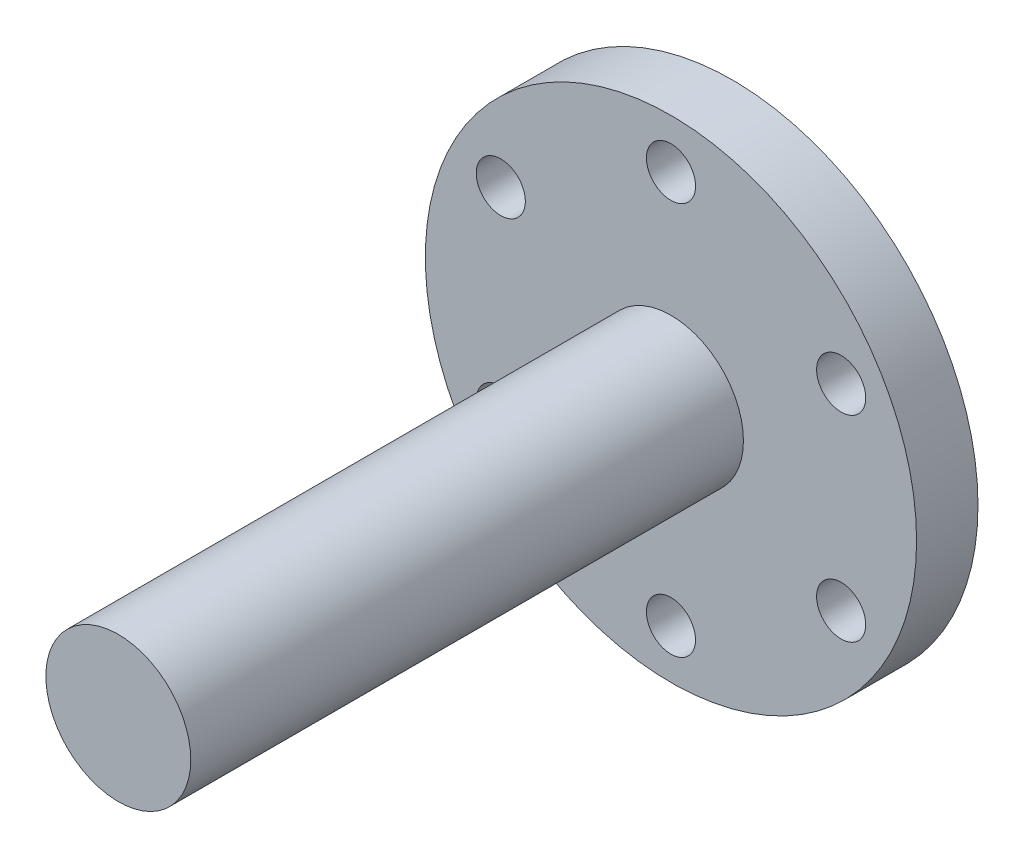
ISO-10303-21;
HEADER;
FILE_DESCRIPTION(('STEP AP214'),'2;1');
FILE_NAME('part.step','',(''),(''),'','','');
FILE_SCHEMA(('AUTOMOTIVE_DESIGN { 1 0 10303 214 1 1 1 1 }'));
ENDSEC;
DATA;
#1=APPLICATION_CONTEXT('core data for automotive mechanical design processes');
#2=APPLICATION_PROTOCOL_DEFINITION('international standard','automotive_design',2000,#1);
#3=PRODUCT_CONTEXT('',#1,'mechanical');
#4=PRODUCT('Part','Part','',(#3));
#5=PRODUCT_RELATED_PRODUCT_CATEGORY('part','',(#4));
#6=PRODUCT_DEFINITION_FORMATION('','',#4);
#7=PRODUCT_DEFINITION_CONTEXT('part definition',#1,'design');
#8=PRODUCT_DEFINITION('design','',#6,#7);
#9=PRODUCT_DEFINITION_SHAPE('','',#8);
#10=(LENGTH_UNIT() NAMED_UNIT(*) SI_UNIT(.MILLI.,.METRE.));
#11=(NAMED_UNIT(*) PLANE_ANGLE_UNIT() SI_UNIT($,.RADIAN.));
#12=(NAMED_UNIT(*) SI_UNIT($,.STERADIAN.) SOLID_ANGLE_UNIT());
#13=UNCERTAINTY_MEASURE_WITH_UNIT(LENGTH_MEASURE(1.E-05),#10,'distance_accuracy_value','');
#14=(GEOMETRIC_REPRESENTATION_CONTEXT(3) GLOBAL_UNCERTAINTY_ASSIGNED_CONTEXT((#13)) GLOBAL_UNIT_ASSIGNED_CONTEXT((#10,
#11,#12)) REPRESENTATION_CONTEXT('',''));
#15=CARTESIAN_POINT('',(0.,0.,0.));
#16=DIRECTION('',(0.,0.,1.));
#17=DIRECTION('',(1.,0.,0.));
#18=AXIS2_PLACEMENT_3D('',#15,#16,#17);
#19=CARTESIAN_POINT('',(0.,0.,5.));
#20=DIRECTION('',(0.,0.,-1.));
#21=DIRECTION('',(-1.,0.,0.));
#22=AXIS2_PLACEMENT_3D('',#19,#20,#21);
#23=CYLINDRICAL_SURFACE('',#22,20.);
#24=CARTESIAN_POINT('',(0.,0.,5.));
#25=DIRECTION('',(0.,0.,1.));
#26=DIRECTION('',(1.,0.,0.));
#27=AXIS2_PLACEMENT_3D('',#24,#25,#26);
#28=CIRCLE('',#27,20.);
#29=CARTESIAN_POINT('',(20.,0.,5.));
#30=VERTEX_POINT('',#29);
#31=EDGE_CURVE('E47',#30,#30,#28,.T.);
#32=ORIENTED_EDGE('',*,*,#31,.F.);
#33=EDGE_LOOP('',(#32));
#34=FACE_BOUND('',#33,.T.);
#35=CARTESIAN_POINT('',(0.,0.,0.));
#36=DIRECTION('',(0.,0.,1.));
#37=DIRECTION('',(1.,0.,0.));
#38=AXIS2_PLACEMENT_3D('',#35,#36,#37);
#39=CIRCLE('',#38,20.);
#40=CARTESIAN_POINT('',(20.,0.,0.));
#41=VERTEX_POINT('',#40);
#42=EDGE_CURVE('E42',#41,#41,#39,.T.);
#43=ORIENTED_EDGE('',*,*,#42,.T.);
#44=EDGE_LOOP('',(#43));
#45=FACE_BOUND('',#44,.T.);
#46=ADVANCED_FACE('F39',(#34,#45),#23,.T.);
#47=CARTESIAN_POINT('',(0.,0.,5.));
#48=DIRECTION('',(0.,0.,1.));
#49=DIRECTION('',(1.,0.,0.));
#50=AXIS2_PLACEMENT_3D('',#47,#48,#49);
#51=PLANE('',#50);
#52=CARTESIAN_POINT('',(0.,16.,5.));
#53=DIRECTION('',(0.,0.,1.));
#54=DIRECTION('',(1.,0.,0.));
#55=AXIS2_PLACEMENT_3D('',#52,#53,#54);
#56=CIRCLE('',#55,2.);
#57=CARTESIAN_POINT('',(2.,16.,5.));
#58=VERTEX_POINT('',#57);
#59=EDGE_CURVE('E92',#58,#58,#56,.T.);
#60=ORIENTED_EDGE('',*,*,#59,.F.);
#61=EDGE_LOOP('',(#60));
#62=FACE_BOUND('',#61,.T.);
#63=CARTESIAN_POINT('',(-13.8564064605506,7.99999999999921,5.));
#64=DIRECTION('',(0.,0.,1.));
#65=DIRECTION('',(1.,0.,0.));
#66=AXIS2_PLACEMENT_3D('',#63,#64,#65);
#67=CIRCLE('',#66,2.00000000000085);
#68=CARTESIAN_POINT('',(-11.8564064605497,7.99999999999921,5.));
#69=VERTEX_POINT('',#68);
#70=EDGE_CURVE('E93',#69,#69,#67,.T.);
#71=ORIENTED_EDGE('',*,*,#70,.F.);
#72=EDGE_LOOP('',(#71));
#73=FACE_BOUND('',#72,.T.);
#74=CARTESIAN_POINT('',(-13.8564064605497,-8.00000000000079,5.));
#75=DIRECTION('',(0.,0.,1.));
#76=DIRECTION('',(1.,0.,0.));
#77=AXIS2_PLACEMENT_3D('',#74,#75,#76);
#78=CIRCLE('',#77,2.00000000000168);
#79=CARTESIAN_POINT('',(-11.856406460548,-8.00000000000079,5.));
#80=VERTEX_POINT('',#79);
#81=EDGE_CURVE('E59',#80,#80,#78,.T.);
#82=ORIENTED_EDGE('',*,*,#81,.F.);
#83=EDGE_LOOP('',(#82));
#84=FACE_BOUND('',#83,.T.);
#85=CARTESIAN_POINT('',(1.81311109890995E-12,-16.,5.));
#86=DIRECTION('',(0.,0.,1.));
#87=DIRECTION('',(1.,0.,0.));
#88=AXIS2_PLACEMENT_3D('',#85,#86,#87);
#89=CIRCLE('',#88,2.00000000000184);
#90=CARTESIAN_POINT('',(2.00000000000365,-16.,5.));
#91=VERTEX_POINT('',#90);
#92=EDGE_CURVE('E68',#91,#91,#89,.T.);
#93=ORIENTED_EDGE('',*,*,#92,.F.);
#94=EDGE_LOOP('',(#93));
#95=FACE_BOUND('',#94,.T.);
#96=CARTESIAN_POINT('',(13.8564064605524,-7.99999999999921,5.));
#97=DIRECTION('',(0.,0.,1.));
#98=DIRECTION('',(1.,0.,0.));
#99=AXIS2_PLACEMENT_3D('',#96,#97,#98);
#100=CIRCLE('',#99,2.00000000000115);
#101=CARTESIAN_POINT('',(15.8564064605535,-7.99999999999921,5.));
#102=VERTEX_POINT('',#101);
#103=EDGE_CURVE('E76',#102,#102,#100,.T.);
#104=ORIENTED_EDGE('',*,*,#103,.F.);
#105=EDGE_LOOP('',(#104));
#106=FACE_BOUND('',#105,.T.);
#107=CARTESIAN_POINT('',(13.8564064605515,8.00000000000079,5.));
#108=DIRECTION('',(0.,0.,1.));
#109=DIRECTION('',(1.,0.,0.));
#110=AXIS2_PLACEMENT_3D('',#107,#108,#109);
#111=CIRCLE('',#110,2.00000000000025);
#112=CARTESIAN_POINT('',(15.8564064605517,8.00000000000079,5.));
#113=VERTEX_POINT('',#112);
#114=EDGE_CURVE('E84',#113,#113,#111,.T.);
#115=ORIENTED_EDGE('',*,*,#114,.F.);
#116=EDGE_LOOP('',(#115));
#117=FACE_BOUND('',#116,.T.);
#118=CARTESIAN_POINT('',(0.,0.,5.));
#119=DIRECTION('',(0.,0.,1.));
#120=DIRECTION('',(1.,0.,0.));
#121=AXIS2_PLACEMENT_3D('',#118,#119,#120);
#122=CIRCLE('',#121,5.9);
#123=CARTESIAN_POINT('',(5.9,0.,5.));
#124=VERTEX_POINT('',#123);
#125=EDGE_CURVE('E10',#124,#124,#122,.T.);
#126=ORIENTED_EDGE('',*,*,#125,.F.);
#127=EDGE_LOOP('',(#126));
#128=FACE_BOUND('',#127,.T.);
#129=ORIENTED_EDGE('',*,*,#31,.T.);
#130=EDGE_LOOP('',(#129));
#131=FACE_BOUND('',#130,.T.);
#132=ADVANCED_FACE('F117',(#62,#73,#84,#95,#106,#117,#128,#131),#51,.T.);
#133=CARTESIAN_POINT('',(0.,0.,0.));
#134=DIRECTION('',(0.,0.,1.));
#135=DIRECTION('',(1.,0.,0.));
#136=AXIS2_PLACEMENT_3D('',#133,#134,#135);
#137=PLANE('',#136);
#138=CARTESIAN_POINT('',(0.,16.,0.));
#139=DIRECTION('',(0.,0.,1.));
#140=DIRECTION('',(1.,0.,0.));
#141=AXIS2_PLACEMENT_3D('',#138,#139,#140);
#142=CIRCLE('',#141,2.);
#143=CARTESIAN_POINT('',(2.,16.,0.));
#144=VERTEX_POINT('',#143);
#145=EDGE_CURVE('E58',#144,#144,#142,.T.);
#146=ORIENTED_EDGE('',*,*,#145,.T.);
#147=EDGE_LOOP('',(#146));
#148=FACE_BOUND('',#147,.T.);
#149=CARTESIAN_POINT('',(-13.8564064605506,7.99999999999921,0.));
#150=DIRECTION('',(0.,0.,1.));
#151=DIRECTION('',(1.,0.,0.));
#152=AXIS2_PLACEMENT_3D('',#149,#150,#151);
#153=CIRCLE('',#152,2.00000000000085);
#154=CARTESIAN_POINT('',(-11.8564064605497,7.99999999999921,0.));
#155=VERTEX_POINT('',#154);
#156=EDGE_CURVE('E64',#155,#155,#153,.T.);
#157=ORIENTED_EDGE('',*,*,#156,.T.);
#158=EDGE_LOOP('',(#157));
#159=FACE_BOUND('',#158,.T.);
#160=CARTESIAN_POINT('',(-13.8564064605497,-8.00000000000079,0.));
#161=DIRECTION('',(0.,0.,1.));
#162=DIRECTION('',(1.,0.,0.));
#163=AXIS2_PLACEMENT_3D('',#160,#161,#162);
#164=CIRCLE('',#163,2.00000000000168);
#165=CARTESIAN_POINT('',(-11.856406460548,-8.00000000000079,0.));
#166=VERTEX_POINT('',#165);
#167=EDGE_CURVE('E63',#166,#166,#164,.T.);
#168=ORIENTED_EDGE('',*,*,#167,.T.);
#169=EDGE_LOOP('',(#168));
#170=FACE_BOUND('',#169,.T.);
#171=CARTESIAN_POINT('',(1.81311109890995E-12,-16.,0.));
#172=DIRECTION('',(0.,0.,1.));
#173=DIRECTION('',(1.,0.,0.));
#174=AXIS2_PLACEMENT_3D('',#171,#172,#173);
#175=CIRCLE('',#174,2.00000000000184);
#176=CARTESIAN_POINT('',(2.00000000000365,-16.,0.));
#177=VERTEX_POINT('',#176);
#178=EDGE_CURVE('E72',#177,#177,#175,.T.);
#179=ORIENTED_EDGE('',*,*,#178,.T.);
#180=EDGE_LOOP('',(#179));
#181=FACE_BOUND('',#180,.T.);
#182=CARTESIAN_POINT('',(13.8564064605524,-7.99999999999921,0.));
#183=DIRECTION('',(0.,0.,1.));
#184=DIRECTION('',(1.,0.,0.));
#185=AXIS2_PLACEMENT_3D('',#182,#183,#184);
#186=CIRCLE('',#185,2.00000000000115);
#187=CARTESIAN_POINT('',(15.8564064605535,-7.99999999999921,0.));
#188=VERTEX_POINT('',#187);
#189=EDGE_CURVE('E80',#188,#188,#186,.T.);
#190=ORIENTED_EDGE('',*,*,#189,.T.);
#191=EDGE_LOOP('',(#190));
#192=FACE_BOUND('',#191,.T.);
#193=CARTESIAN_POINT('',(13.8564064605515,8.00000000000079,0.));
#194=DIRECTION('',(0.,0.,1.));
#195=DIRECTION('',(1.,0.,0.));
#196=AXIS2_PLACEMENT_3D('',#193,#194,#195);
#197=CIRCLE('',#196,2.00000000000025);
#198=CARTESIAN_POINT('',(15.8564064605517,8.00000000000079,0.));
#199=VERTEX_POINT('',#198);
#200=EDGE_CURVE('E88',#199,#199,#197,.T.);
#201=ORIENTED_EDGE('',*,*,#200,.T.);
#202=EDGE_LOOP('',(#201));
#203=FACE_BOUND('',#202,.T.);
#204=ORIENTED_EDGE('',*,*,#42,.F.);
#205=EDGE_LOOP('',(#204));
#206=FACE_BOUND('',#205,.T.);
#207=ADVANCED_FACE('F107',(#148,#159,#170,#181,#192,#203,#206),#137,.F.);
#208=CARTESIAN_POINT('',(0.,0.,50.));
#209=DIRECTION('',(0.,0.,-1.));
#210=DIRECTION('',(-1.,0.,0.));
#211=AXIS2_PLACEMENT_3D('',#208,#209,#210);
#212=CYLINDRICAL_SURFACE('',#211,5.9);
#213=CARTESIAN_POINT('',(0.,0.,50.));
#214=DIRECTION('',(0.,0.,1.));
#215=DIRECTION('',(1.,0.,0.));
#216=AXIS2_PLACEMENT_3D('',#213,#214,#215);
#217=CIRCLE('',#216,5.9);
#218=CARTESIAN_POINT('',(5.9,0.,50.));
#219=VERTEX_POINT('',#218);
#220=EDGE_CURVE('E54',#219,#219,#217,.T.);
#221=ORIENTED_EDGE('',*,*,#220,.F.);
#222=EDGE_LOOP('',(#221));
#223=FACE_BOUND('',#222,.T.);
#224=ORIENTED_EDGE('',*,*,#125,.T.);
#225=EDGE_LOOP('',(#224));
#226=FACE_BOUND('',#225,.T.);
#227=ADVANCED_FACE('F141',(#223,#226),#212,.T.);
#228=CARTESIAN_POINT('',(0.,0.,50.));
#229=DIRECTION('',(0.,0.,1.));
#230=DIRECTION('',(1.,0.,0.));
#231=AXIS2_PLACEMENT_3D('',#228,#229,#230);
#232=PLANE('',#231);
#233=ORIENTED_EDGE('',*,*,#220,.T.);
#234=EDGE_LOOP('',(#233));
#235=FACE_BOUND('',#234,.T.);
#236=ADVANCED_FACE('F145',(#235),#232,.T.);
#237=CARTESIAN_POINT('',(13.8564064605515,8.00000000000079,0.));
#238=DIRECTION('',(0.,0.,1.));
#239=DIRECTION('',(1.,0.,0.));
#240=AXIS2_PLACEMENT_3D('',#237,#238,#239);
#241=CYLINDRICAL_SURFACE('',#240,2.00000000000025);
#242=ORIENTED_EDGE('',*,*,#200,.F.);
#243=EDGE_LOOP('',(#242));
#244=FACE_BOUND('',#243,.T.);
#245=ORIENTED_EDGE('',*,*,#114,.T.);
#246=EDGE_LOOP('',(#245));
#247=FACE_BOUND('',#246,.T.);
#248=ADVANCED_FACE('F151',(#244,#247),#241,.F.);
#249=CARTESIAN_POINT('',(13.8564064605524,-7.99999999999921,0.));
#250=DIRECTION('',(0.,0.,1.));
#251=DIRECTION('',(1.,0.,0.));
#252=AXIS2_PLACEMENT_3D('',#249,#250,#251);
#253=CYLINDRICAL_SURFACE('',#252,2.00000000000115);
#254=ORIENTED_EDGE('',*,*,#189,.F.);
#255=EDGE_LOOP('',(#254));
#256=FACE_BOUND('',#255,.T.);
#257=ORIENTED_EDGE('',*,*,#103,.T.);
#258=EDGE_LOOP('',(#257));
#259=FACE_BOUND('',#258,.T.);
#260=ADVANCED_FACE('F160',(#256,#259),#253,.F.);
#261=CARTESIAN_POINT('',(1.81311109890995E-12,-16.,0.));
#262=DIRECTION('',(0.,0.,1.));
#263=DIRECTION('',(1.,0.,0.));
#264=AXIS2_PLACEMENT_3D('',#261,#262,#263);
#265=CYLINDRICAL_SURFACE('',#264,2.00000000000184);
#266=ORIENTED_EDGE('',*,*,#178,.F.);
#267=EDGE_LOOP('',(#266));
#268=FACE_BOUND('',#267,.T.);
#269=ORIENTED_EDGE('',*,*,#92,.T.);
#270=EDGE_LOOP('',(#269));
#271=FACE_BOUND('',#270,.T.);
#272=ADVANCED_FACE('F156',(#268,#271),#265,.F.);
#273=CARTESIAN_POINT('',(-13.8564064605497,-8.00000000000079,0.));
#274=DIRECTION('',(0.,0.,1.));
#275=DIRECTION('',(1.,0.,0.));
#276=AXIS2_PLACEMENT_3D('',#273,#274,#275);
#277=CYLINDRICAL_SURFACE('',#276,2.00000000000168);
#278=ORIENTED_EDGE('',*,*,#167,.F.);
#279=EDGE_LOOP('',(#278));
#280=FACE_BOUND('',#279,.T.);
#281=ORIENTED_EDGE('',*,*,#81,.T.);
#282=EDGE_LOOP('',(#281));
#283=FACE_BOUND('',#282,.T.);
#284=ADVANCED_FACE('F153',(#280,#283),#277,.F.);
#285=CARTESIAN_POINT('',(-13.8564064605506,7.99999999999921,0.));
#286=DIRECTION('',(0.,0.,1.));
#287=DIRECTION('',(1.,0.,0.));
#288=AXIS2_PLACEMENT_3D('',#285,#286,#287);
#289=CYLINDRICAL_SURFACE('',#288,2.00000000000085);
#290=ORIENTED_EDGE('',*,*,#156,.F.);
#291=EDGE_LOOP('',(#290));
#292=FACE_BOUND('',#291,.T.);
#293=ORIENTED_EDGE('',*,*,#70,.T.);
#294=EDGE_LOOP('',(#293));
#295=FACE_BOUND('',#294,.T.);
#296=ADVANCED_FACE('F113',(#292,#295),#289,.F.);
#297=CARTESIAN_POINT('',(0.,16.,0.));
#298=DIRECTION('',(0.,0.,1.));
#299=DIRECTION('',(1.,0.,0.));
#300=AXIS2_PLACEMENT_3D('',#297,#298,#299);
#301=CYLINDRICAL_SURFACE('',#300,2.);
#302=ORIENTED_EDGE('',*,*,#145,.F.);
#303=EDGE_LOOP('',(#302));
#304=FACE_BOUND('',#303,.T.);
#305=ORIENTED_EDGE('',*,*,#59,.T.);
#306=EDGE_LOOP('',(#305));
#307=FACE_BOUND('',#306,.T.);
#308=ADVANCED_FACE('F110',(#304,#307),#301,.F.);
#309=CLOSED_SHELL('',(#46,#132,#207,#227,#236,#248,#260,#272,#284,#296,#308));
#310=MANIFOLD_SOLID_BREP('B2',#309);
#311=ADVANCED_BREP_SHAPE_REPRESENTATION('',(#18,#310),#14);
#312=SHAPE_DEFINITION_REPRESENTATION(#9,#311);
ENDSEC;
END-ISO-10303-21;
